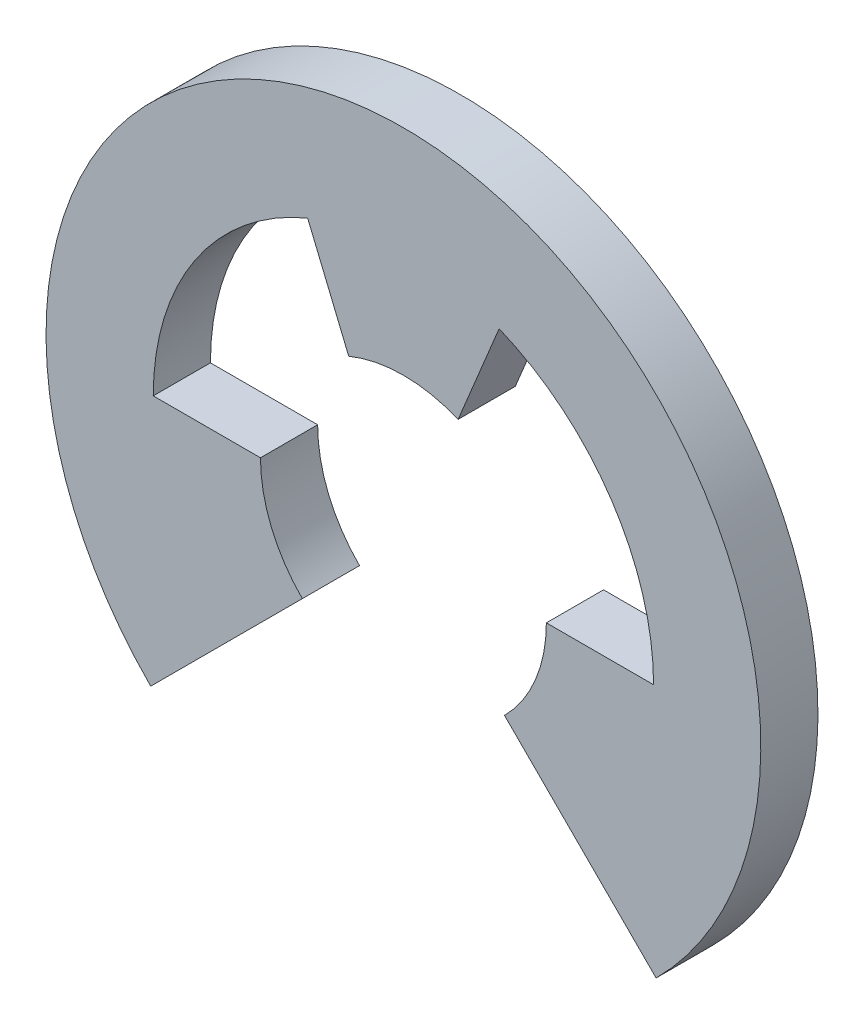
ISO-10303-21;
HEADER;
FILE_DESCRIPTION(('STEP AP214'),'2;1');
FILE_NAME('part.step','',(''),(''),'','','');
FILE_SCHEMA(('AUTOMOTIVE_DESIGN { 1 0 10303 214 1 1 1 1 }'));
ENDSEC;
DATA;
#1=APPLICATION_CONTEXT('core data for automotive mechanical design processes');
#2=APPLICATION_PROTOCOL_DEFINITION('international standard','automotive_design',2000,#1);
#3=PRODUCT_CONTEXT('',#1,'mechanical');
#4=PRODUCT('Part','Part','',(#3));
#5=PRODUCT_RELATED_PRODUCT_CATEGORY('part','',(#4));
#6=PRODUCT_DEFINITION_FORMATION('','',#4);
#7=PRODUCT_DEFINITION_CONTEXT('part definition',#1,'design');
#8=PRODUCT_DEFINITION('design','',#6,#7);
#9=PRODUCT_DEFINITION_SHAPE('','',#8);
#10=(LENGTH_UNIT() NAMED_UNIT(*) SI_UNIT(.MILLI.,.METRE.));
#11=(NAMED_UNIT(*) PLANE_ANGLE_UNIT() SI_UNIT($,.RADIAN.));
#12=(NAMED_UNIT(*) SI_UNIT($,.STERADIAN.) SOLID_ANGLE_UNIT());
#13=UNCERTAINTY_MEASURE_WITH_UNIT(LENGTH_MEASURE(1.E-05),#10,'distance_accuracy_value','');
#14=(GEOMETRIC_REPRESENTATION_CONTEXT(3) GLOBAL_UNCERTAINTY_ASSIGNED_CONTEXT((#13)) GLOBAL_UNIT_ASSIGNED_CONTEXT((#10,
#11,#12)) REPRESENTATION_CONTEXT('',''));
#15=CARTESIAN_POINT('',(0.,0.,0.));
#16=DIRECTION('',(0.,0.,1.));
#17=DIRECTION('',(1.,0.,0.));
#18=AXIS2_PLACEMENT_3D('',#15,#16,#17);
#19=CARTESIAN_POINT('',(0.,0.,-0.4));
#20=DIRECTION('',(0.,0.,1.));
#21=DIRECTION('',(1.,0.,0.));
#22=AXIS2_PLACEMENT_3D('',#19,#20,#21);
#23=CYLINDRICAL_SURFACE('',#22,1.);
#24=CARTESIAN_POINT('',(0.,0.,0.));
#25=DIRECTION('',(0.,0.,-1.));
#26=DIRECTION('',(1.,0.,0.));
#27=AXIS2_PLACEMENT_3D('',#24,#25,#26);
#28=CIRCLE('',#27,1.);
#29=CARTESIAN_POINT('',(1.,0.,0.));
#30=VERTEX_POINT('',#29);
#31=CARTESIAN_POINT('',(0.707106781186549,-0.707106781186546,0.));
#32=VERTEX_POINT('',#31);
#33=EDGE_CURVE('E153',#30,#32,#28,.T.);
#34=ORIENTED_EDGE('',*,*,#33,.F.);
#35=DIRECTION('',(0.,0.,1.));
#36=VECTOR('',#35,1.);
#37=CARTESIAN_POINT('',(1.,0.,-0.4));
#38=LINE('',#37,#36);
#39=CARTESIAN_POINT('',(1.,0.,-0.4));
#40=VERTEX_POINT('',#39);
#41=EDGE_CURVE('E11',#40,#30,#38,.T.);
#42=ORIENTED_EDGE('',*,*,#41,.F.);
#43=CARTESIAN_POINT('',(0.,0.,-0.4));
#44=DIRECTION('',(0.,0.,-1.));
#45=DIRECTION('',(1.,0.,0.));
#46=AXIS2_PLACEMENT_3D('',#43,#44,#45);
#47=CIRCLE('',#46,1.);
#48=CARTESIAN_POINT('',(0.707106781186549,-0.707106781186546,-0.4));
#49=VERTEX_POINT('',#48);
#50=EDGE_CURVE('E185',#40,#49,#47,.T.);
#51=ORIENTED_EDGE('',*,*,#50,.T.);
#52=DIRECTION('',(0.,0.,1.));
#53=VECTOR('',#52,1.);
#54=CARTESIAN_POINT('',(0.707106781186549,-0.707106781186546,-0.4));
#55=LINE('',#54,#53);
#56=EDGE_CURVE('E35',#49,#32,#55,.T.);
#57=ORIENTED_EDGE('',*,*,#56,.T.);
#58=EDGE_LOOP('',(#34,#42,#51,#57));
#59=FACE_BOUND('',#58,.T.);
#60=ADVANCED_FACE('F32',(#59),#23,.F.);
#61=CARTESIAN_POINT('',(1.,0.,-0.4));
#62=DIRECTION('',(0.,1.,0.));
#63=DIRECTION('',(-1.,0.,0.));
#64=AXIS2_PLACEMENT_3D('',#61,#62,#63);
#65=PLANE('',#64);
#66=DIRECTION('',(-1.,0.,0.));
#67=VECTOR('',#66,1.);
#68=CARTESIAN_POINT('',(1.,0.,0.));
#69=LINE('',#68,#67);
#70=CARTESIAN_POINT('',(1.75,0.,0.));
#71=VERTEX_POINT('',#70);
#72=EDGE_CURVE('E183',#71,#30,#69,.T.);
#73=ORIENTED_EDGE('',*,*,#72,.F.);
#74=DIRECTION('',(0.,0.,1.));
#75=VECTOR('',#74,1.);
#76=CARTESIAN_POINT('',(1.75,0.,-0.4));
#77=LINE('',#76,#75);
#78=CARTESIAN_POINT('',(1.75,0.,-0.4));
#79=VERTEX_POINT('',#78);
#80=EDGE_CURVE('E41',#79,#71,#77,.T.);
#81=ORIENTED_EDGE('',*,*,#80,.F.);
#82=DIRECTION('',(-1.,0.,0.));
#83=VECTOR('',#82,1.);
#84=CARTESIAN_POINT('',(1.,0.,-0.4));
#85=LINE('',#84,#83);
#86=EDGE_CURVE('E143',#79,#40,#85,.T.);
#87=ORIENTED_EDGE('',*,*,#86,.T.);
#88=ORIENTED_EDGE('',*,*,#41,.T.);
#89=EDGE_LOOP('',(#73,#81,#87,#88));
#90=FACE_BOUND('',#89,.T.);
#91=ADVANCED_FACE('F205',(#90),#65,.T.);
#92=CARTESIAN_POINT('',(0.,0.,-0.4));
#93=DIRECTION('',(0.,0.,1.));
#94=DIRECTION('',(1.,0.,0.));
#95=AXIS2_PLACEMENT_3D('',#92,#93,#94);
#96=CYLINDRICAL_SURFACE('',#95,1.75);
#97=CARTESIAN_POINT('',(0.,0.,0.));
#98=DIRECTION('',(0.,0.,-1.));
#99=DIRECTION('',(1.,0.,0.));
#100=AXIS2_PLACEMENT_3D('',#97,#98,#99);
#101=CIRCLE('',#100,1.75);
#102=CARTESIAN_POINT('',(0.669696006638908,1.61678918189475,0.));
#103=VERTEX_POINT('',#102);
#104=EDGE_CURVE('E130',#103,#71,#101,.T.);
#105=ORIENTED_EDGE('',*,*,#104,.F.);
#106=DIRECTION('',(0.,0.,1.));
#107=VECTOR('',#106,1.);
#108=CARTESIAN_POINT('',(0.669696006638908,1.61678918189475,-0.4));
#109=LINE('',#108,#107);
#110=CARTESIAN_POINT('',(0.669696006638908,1.61678918189475,-0.4));
#111=VERTEX_POINT('',#110);
#112=EDGE_CURVE('E125',#111,#103,#109,.T.);
#113=ORIENTED_EDGE('',*,*,#112,.F.);
#114=CARTESIAN_POINT('',(0.,0.,-0.4));
#115=DIRECTION('',(0.,0.,-1.));
#116=DIRECTION('',(1.,0.,0.));
#117=AXIS2_PLACEMENT_3D('',#114,#115,#116);
#118=CIRCLE('',#117,1.75);
#119=EDGE_CURVE('E128',#111,#79,#118,.T.);
#120=ORIENTED_EDGE('',*,*,#119,.T.);
#121=ORIENTED_EDGE('',*,*,#80,.T.);
#122=EDGE_LOOP('',(#105,#113,#120,#121));
#123=FACE_BOUND('',#122,.T.);
#124=ADVANCED_FACE('F127',(#123),#96,.F.);
#125=CARTESIAN_POINT('',(0.38268343236509,0.923879532511287,-0.4));
#126=DIRECTION('',(0.923879532511287,-0.38268343236509,0.));
#127=DIRECTION('',(0.38268343236509,0.923879532511287,0.));
#128=AXIS2_PLACEMENT_3D('',#125,#126,#127);
#129=PLANE('',#128);
#130=DIRECTION('',(0.38268343236509,0.923879532511287,0.));
#131=VECTOR('',#130,1.);
#132=CARTESIAN_POINT('',(0.38268343236509,0.923879532511287,0.));
#133=LINE('',#132,#131);
#134=CARTESIAN_POINT('',(0.38268343236509,0.923879532511287,0.));
#135=VERTEX_POINT('',#134);
#136=EDGE_CURVE('E180',#135,#103,#133,.T.);
#137=ORIENTED_EDGE('',*,*,#136,.F.);
#138=DIRECTION('',(0.,0.,1.));
#139=VECTOR('',#138,1.);
#140=CARTESIAN_POINT('',(0.38268343236509,0.923879532511287,-0.4));
#141=LINE('',#140,#139);
#142=CARTESIAN_POINT('',(0.38268343236509,0.923879532511287,-0.4));
#143=VERTEX_POINT('',#142);
#144=EDGE_CURVE('E135',#143,#135,#141,.T.);
#145=ORIENTED_EDGE('',*,*,#144,.F.);
#146=DIRECTION('',(0.38268343236509,0.923879532511287,0.));
#147=VECTOR('',#146,1.);
#148=CARTESIAN_POINT('',(0.38268343236509,0.923879532511287,-0.4));
#149=LINE('',#148,#147);
#150=EDGE_CURVE('E141',#143,#111,#149,.T.);
#151=ORIENTED_EDGE('',*,*,#150,.T.);
#152=ORIENTED_EDGE('',*,*,#112,.T.);
#153=EDGE_LOOP('',(#137,#145,#151,#152));
#154=FACE_BOUND('',#153,.T.);
#155=ADVANCED_FACE('F145',(#154),#129,.T.);
#156=CARTESIAN_POINT('',(0.,0.,-0.4));
#157=DIRECTION('',(0.,0.,1.));
#158=DIRECTION('',(1.,0.,0.));
#159=AXIS2_PLACEMENT_3D('',#156,#157,#158);
#160=CYLINDRICAL_SURFACE('',#159,1.);
#161=CARTESIAN_POINT('',(0.,0.,0.));
#162=DIRECTION('',(0.,0.,-1.));
#163=DIRECTION('',(1.,0.,0.));
#164=AXIS2_PLACEMENT_3D('',#161,#162,#163);
#165=CIRCLE('',#164,1.);
#166=CARTESIAN_POINT('',(-0.38268343236509,0.923879532511287,0.));
#167=VERTEX_POINT('',#166);
#168=EDGE_CURVE('E177',#167,#135,#165,.T.);
#169=ORIENTED_EDGE('',*,*,#168,.F.);
#170=DIRECTION('',(0.,0.,1.));
#171=VECTOR('',#170,1.);
#172=CARTESIAN_POINT('',(-0.38268343236509,0.923879532511287,-0.4));
#173=LINE('',#172,#171);
#174=CARTESIAN_POINT('',(-0.38268343236509,0.923879532511287,-0.4));
#175=VERTEX_POINT('',#174);
#176=EDGE_CURVE('E189',#175,#167,#173,.T.);
#177=ORIENTED_EDGE('',*,*,#176,.F.);
#178=CARTESIAN_POINT('',(0.,0.,-0.4));
#179=DIRECTION('',(0.,0.,-1.));
#180=DIRECTION('',(1.,0.,0.));
#181=AXIS2_PLACEMENT_3D('',#178,#179,#180);
#182=CIRCLE('',#181,1.);
#183=EDGE_CURVE('E146',#175,#143,#182,.T.);
#184=ORIENTED_EDGE('',*,*,#183,.T.);
#185=ORIENTED_EDGE('',*,*,#144,.T.);
#186=EDGE_LOOP('',(#169,#177,#184,#185));
#187=FACE_BOUND('',#186,.T.);
#188=ADVANCED_FACE('F218',(#187),#160,.F.);
#189=CARTESIAN_POINT('',(-0.38268343236509,0.923879532511287,-0.4));
#190=DIRECTION('',(-0.923879532511287,-0.38268343236509,0.));
#191=DIRECTION('',(0.38268343236509,-0.923879532511287,0.));
#192=AXIS2_PLACEMENT_3D('',#189,#190,#191);
#193=PLANE('',#192);
#194=DIRECTION('',(0.38268343236509,-0.923879532511287,0.));
#195=VECTOR('',#194,1.);
#196=CARTESIAN_POINT('',(-0.38268343236509,0.923879532511287,0.));
#197=LINE('',#196,#195);
#198=CARTESIAN_POINT('',(-0.669696006638908,1.61678918189475,0.));
#199=VERTEX_POINT('',#198);
#200=EDGE_CURVE('E174',#199,#167,#197,.T.);
#201=ORIENTED_EDGE('',*,*,#200,.F.);
#202=DIRECTION('',(0.,0.,1.));
#203=VECTOR('',#202,1.);
#204=CARTESIAN_POINT('',(-0.669696006638908,1.61678918189475,-0.4));
#205=LINE('',#204,#203);
#206=CARTESIAN_POINT('',(-0.669696006638908,1.61678918189475,-0.4));
#207=VERTEX_POINT('',#206);
#208=EDGE_CURVE('E191',#207,#199,#205,.T.);
#209=ORIENTED_EDGE('',*,*,#208,.F.);
#210=DIRECTION('',(0.38268343236509,-0.923879532511287,0.));
#211=VECTOR('',#210,1.);
#212=CARTESIAN_POINT('',(-0.38268343236509,0.923879532511287,-0.4));
#213=LINE('',#212,#211);
#214=EDGE_CURVE('E148',#207,#175,#213,.T.);
#215=ORIENTED_EDGE('',*,*,#214,.T.);
#216=ORIENTED_EDGE('',*,*,#176,.T.);
#217=EDGE_LOOP('',(#201,#209,#215,#216));
#218=FACE_BOUND('',#217,.T.);
#219=ADVANCED_FACE('F221',(#218),#193,.T.);
#220=CARTESIAN_POINT('',(0.,0.,-0.4));
#221=DIRECTION('',(0.,0.,1.));
#222=DIRECTION('',(1.,0.,0.));
#223=AXIS2_PLACEMENT_3D('',#220,#221,#222);
#224=CYLINDRICAL_SURFACE('',#223,1.75);
#225=CARTESIAN_POINT('',(0.,0.,0.));
#226=DIRECTION('',(0.,0.,-1.));
#227=DIRECTION('',(1.,0.,0.));
#228=AXIS2_PLACEMENT_3D('',#225,#226,#227);
#229=CIRCLE('',#228,1.75);
#230=CARTESIAN_POINT('',(-1.75,0.,0.));
#231=VERTEX_POINT('',#230);
#232=EDGE_CURVE('E171',#231,#199,#229,.T.);
#233=ORIENTED_EDGE('',*,*,#232,.F.);
#234=DIRECTION('',(0.,0.,1.));
#235=VECTOR('',#234,1.);
#236=CARTESIAN_POINT('',(-1.75,0.,-0.4));
#237=LINE('',#236,#235);
#238=CARTESIAN_POINT('',(-1.75,0.,-0.4));
#239=VERTEX_POINT('',#238);
#240=EDGE_CURVE('E193',#239,#231,#237,.T.);
#241=ORIENTED_EDGE('',*,*,#240,.F.);
#242=CARTESIAN_POINT('',(0.,0.,-0.4));
#243=DIRECTION('',(0.,0.,-1.));
#244=DIRECTION('',(1.,0.,0.));
#245=AXIS2_PLACEMENT_3D('',#242,#243,#244);
#246=CIRCLE('',#245,1.75);
#247=EDGE_CURVE('E375',#239,#207,#246,.T.);
#248=ORIENTED_EDGE('',*,*,#247,.T.);
#249=ORIENTED_EDGE('',*,*,#208,.T.);
#250=EDGE_LOOP('',(#233,#241,#248,#249));
#251=FACE_BOUND('',#250,.T.);
#252=ADVANCED_FACE('F225',(#251),#224,.F.);
#253=CARTESIAN_POINT('',(-1.,0.,-0.4));
#254=DIRECTION('',(0.,1.,0.));
#255=DIRECTION('',(-1.,0.,0.));
#256=AXIS2_PLACEMENT_3D('',#253,#254,#255);
#257=PLANE('',#256);
#258=DIRECTION('',(-1.,0.,0.));
#259=VECTOR('',#258,1.);
#260=CARTESIAN_POINT('',(-1.,0.,0.));
#261=LINE('',#260,#259);
#262=CARTESIAN_POINT('',(-1.,0.,0.));
#263=VERTEX_POINT('',#262);
#264=EDGE_CURVE('E168',#263,#231,#261,.T.);
#265=ORIENTED_EDGE('',*,*,#264,.F.);
#266=DIRECTION('',(0.,0.,1.));
#267=VECTOR('',#266,1.);
#268=CARTESIAN_POINT('',(-1.,0.,-0.4));
#269=LINE('',#268,#267);
#270=CARTESIAN_POINT('',(-1.,0.,-0.4));
#271=VERTEX_POINT('',#270);
#272=EDGE_CURVE('E195',#271,#263,#269,.T.);
#273=ORIENTED_EDGE('',*,*,#272,.F.);
#274=DIRECTION('',(-1.,0.,0.));
#275=VECTOR('',#274,1.);
#276=CARTESIAN_POINT('',(-1.,0.,-0.4));
#277=LINE('',#276,#275);
#278=EDGE_CURVE('E379',#271,#239,#277,.T.);
#279=ORIENTED_EDGE('',*,*,#278,.T.);
#280=ORIENTED_EDGE('',*,*,#240,.T.);
#281=EDGE_LOOP('',(#265,#273,#279,#280));
#282=FACE_BOUND('',#281,.T.);
#283=ADVANCED_FACE('F229',(#282),#257,.T.);
#284=CARTESIAN_POINT('',(0.,0.,-0.4));
#285=DIRECTION('',(0.,0.,1.));
#286=DIRECTION('',(1.,0.,0.));
#287=AXIS2_PLACEMENT_3D('',#284,#285,#286);
#288=CYLINDRICAL_SURFACE('',#287,1.);
#289=CARTESIAN_POINT('',(0.,0.,0.));
#290=DIRECTION('',(0.,0.,-1.));
#291=DIRECTION('',(1.,0.,0.));
#292=AXIS2_PLACEMENT_3D('',#289,#290,#291);
#293=CIRCLE('',#292,1.);
#294=CARTESIAN_POINT('',(-0.707106781186549,-0.707106781186546,0.));
#295=VERTEX_POINT('',#294);
#296=EDGE_CURVE('E165',#295,#263,#293,.T.);
#297=ORIENTED_EDGE('',*,*,#296,.F.);
#298=DIRECTION('',(0.,0.,1.));
#299=VECTOR('',#298,1.);
#300=CARTESIAN_POINT('',(-0.707106781186549,-0.707106781186546,-0.4));
#301=LINE('',#300,#299);
#302=CARTESIAN_POINT('',(-0.707106781186549,-0.707106781186546,-0.4));
#303=VERTEX_POINT('',#302);
#304=EDGE_CURVE('E197',#303,#295,#301,.T.);
#305=ORIENTED_EDGE('',*,*,#304,.F.);
#306=CARTESIAN_POINT('',(0.,0.,-0.4));
#307=DIRECTION('',(0.,0.,-1.));
#308=DIRECTION('',(1.,0.,0.));
#309=AXIS2_PLACEMENT_3D('',#306,#307,#308);
#310=CIRCLE('',#309,1.);
#311=EDGE_CURVE('E368',#303,#271,#310,.T.);
#312=ORIENTED_EDGE('',*,*,#311,.T.);
#313=ORIENTED_EDGE('',*,*,#272,.T.);
#314=EDGE_LOOP('',(#297,#305,#312,#313));
#315=FACE_BOUND('',#314,.T.);
#316=ADVANCED_FACE('F233',(#315),#288,.F.);
#317=CARTESIAN_POINT('',(-0.707106781186549,-0.707106781186546,-0.4));
#318=DIRECTION('',(0.707106781186546,-0.707106781186549,0.));
#319=DIRECTION('',(0.707106781186549,0.707106781186546,0.));
#320=AXIS2_PLACEMENT_3D('',#317,#318,#319);
#321=PLANE('',#320);
#322=DIRECTION('',(0.707106781186549,0.707106781186546,0.));
#323=VECTOR('',#322,1.);
#324=CARTESIAN_POINT('',(-0.707106781186549,-0.707106781186546,0.));
#325=LINE('',#324,#323);
#326=CARTESIAN_POINT('',(-1.76776695296637,-1.76776695296637,0.));
#327=VERTEX_POINT('',#326);
#328=EDGE_CURVE('E162',#327,#295,#325,.T.);
#329=ORIENTED_EDGE('',*,*,#328,.F.);
#330=DIRECTION('',(0.,0.,1.));
#331=VECTOR('',#330,1.);
#332=CARTESIAN_POINT('',(-1.76776695296637,-1.76776695296637,-0.4));
#333=LINE('',#332,#331);
#334=CARTESIAN_POINT('',(-1.76776695296637,-1.76776695296637,-0.4));
#335=VERTEX_POINT('',#334);
#336=EDGE_CURVE('E199',#335,#327,#333,.T.);
#337=ORIENTED_EDGE('',*,*,#336,.F.);
#338=DIRECTION('',(0.707106781186549,0.707106781186546,0.));
#339=VECTOR('',#338,1.);
#340=CARTESIAN_POINT('',(-0.707106781186549,-0.707106781186546,-0.4));
#341=LINE('',#340,#339);
#342=EDGE_CURVE('E364',#335,#303,#341,.T.);
#343=ORIENTED_EDGE('',*,*,#342,.T.);
#344=ORIENTED_EDGE('',*,*,#304,.T.);
#345=EDGE_LOOP('',(#329,#337,#343,#344));
#346=FACE_BOUND('',#345,.T.);
#347=ADVANCED_FACE('F237',(#346),#321,.T.);
#348=CARTESIAN_POINT('',(0.,0.,-0.4));
#349=DIRECTION('',(0.,0.,1.));
#350=DIRECTION('',(1.,0.,0.));
#351=AXIS2_PLACEMENT_3D('',#348,#349,#350);
#352=CYLINDRICAL_SURFACE('',#351,2.5);
#353=CARTESIAN_POINT('',(0.,0.,0.));
#354=DIRECTION('',(0.,0.,1.));
#355=DIRECTION('',(1.,0.,0.));
#356=AXIS2_PLACEMENT_3D('',#353,#354,#355);
#357=CIRCLE('',#356,2.5);
#358=CARTESIAN_POINT('',(1.76776695296637,-1.76776695296637,0.));
#359=VERTEX_POINT('',#358);
#360=EDGE_CURVE('E159',#359,#327,#357,.T.);
#361=ORIENTED_EDGE('',*,*,#360,.F.);
#362=DIRECTION('',(0.,0.,1.));
#363=VECTOR('',#362,1.);
#364=CARTESIAN_POINT('',(1.76776695296637,-1.76776695296637,-0.4));
#365=LINE('',#364,#363);
#366=CARTESIAN_POINT('',(1.76776695296637,-1.76776695296637,-0.4));
#367=VERTEX_POINT('',#366);
#368=EDGE_CURVE('E200',#367,#359,#365,.T.);
#369=ORIENTED_EDGE('',*,*,#368,.F.);
#370=CARTESIAN_POINT('',(0.,0.,-0.4));
#371=DIRECTION('',(0.,0.,1.));
#372=DIRECTION('',(1.,0.,0.));
#373=AXIS2_PLACEMENT_3D('',#370,#371,#372);
#374=CIRCLE('',#373,2.5);
#375=EDGE_CURVE('E385',#367,#335,#374,.T.);
#376=ORIENTED_EDGE('',*,*,#375,.T.);
#377=ORIENTED_EDGE('',*,*,#336,.T.);
#378=EDGE_LOOP('',(#361,#369,#376,#377));
#379=FACE_BOUND('',#378,.T.);
#380=ADVANCED_FACE('F241',(#379),#352,.T.);
#381=CARTESIAN_POINT('',(0.707106781186549,-0.707106781186546,-0.4));
#382=DIRECTION('',(-0.707106781186546,-0.707106781186549,0.));
#383=DIRECTION('',(0.707106781186549,-0.707106781186546,0.));
#384=AXIS2_PLACEMENT_3D('',#381,#382,#383);
#385=PLANE('',#384);
#386=DIRECTION('',(0.707106781186549,-0.707106781186546,0.));
#387=VECTOR('',#386,1.);
#388=CARTESIAN_POINT('',(0.707106781186549,-0.707106781186546,0.));
#389=LINE('',#388,#387);
#390=EDGE_CURVE('E156',#32,#359,#389,.T.);
#391=ORIENTED_EDGE('',*,*,#390,.F.);
#392=ORIENTED_EDGE('',*,*,#56,.F.);
#393=DIRECTION('',(0.707106781186549,-0.707106781186546,0.));
#394=VECTOR('',#393,1.);
#395=CARTESIAN_POINT('',(0.707106781186549,-0.707106781186546,-0.4));
#396=LINE('',#395,#394);
#397=EDGE_CURVE('E387',#49,#367,#396,.T.);
#398=ORIENTED_EDGE('',*,*,#397,.T.);
#399=ORIENTED_EDGE('',*,*,#368,.T.);
#400=EDGE_LOOP('',(#391,#392,#398,#399));
#401=FACE_BOUND('',#400,.T.);
#402=ADVANCED_FACE('F202',(#401),#385,.T.);
#403=CARTESIAN_POINT('',(0.,0.,-0.4));
#404=DIRECTION('',(0.,0.,1.));
#405=DIRECTION('',(1.,0.,0.));
#406=AXIS2_PLACEMENT_3D('',#403,#404,#405);
#407=PLANE('',#406);
#408=ORIENTED_EDGE('',*,*,#50,.F.);
#409=ORIENTED_EDGE('',*,*,#86,.F.);
#410=ORIENTED_EDGE('',*,*,#119,.F.);
#411=ORIENTED_EDGE('',*,*,#150,.F.);
#412=ORIENTED_EDGE('',*,*,#183,.F.);
#413=ORIENTED_EDGE('',*,*,#214,.F.);
#414=ORIENTED_EDGE('',*,*,#247,.F.);
#415=ORIENTED_EDGE('',*,*,#278,.F.);
#416=ORIENTED_EDGE('',*,*,#311,.F.);
#417=ORIENTED_EDGE('',*,*,#342,.F.);
#418=ORIENTED_EDGE('',*,*,#375,.F.);
#419=ORIENTED_EDGE('',*,*,#397,.F.);
#420=EDGE_LOOP('',(#408,#409,#410,#411,#412,#413,#414,#415,#416,#417,#418,#419));
#421=FACE_BOUND('',#420,.T.);
#422=ADVANCED_FACE('F139',(#421),#407,.F.);
#423=CARTESIAN_POINT('',(0.,0.,0.));
#424=DIRECTION('',(0.,0.,1.));
#425=DIRECTION('',(1.,0.,0.));
#426=AXIS2_PLACEMENT_3D('',#423,#424,#425);
#427=PLANE('',#426);
#428=ORIENTED_EDGE('',*,*,#33,.T.);
#429=ORIENTED_EDGE('',*,*,#390,.T.);
#430=ORIENTED_EDGE('',*,*,#360,.T.);
#431=ORIENTED_EDGE('',*,*,#328,.T.);
#432=ORIENTED_EDGE('',*,*,#296,.T.);
#433=ORIENTED_EDGE('',*,*,#264,.T.);
#434=ORIENTED_EDGE('',*,*,#232,.T.);
#435=ORIENTED_EDGE('',*,*,#200,.T.);
#436=ORIENTED_EDGE('',*,*,#168,.T.);
#437=ORIENTED_EDGE('',*,*,#136,.T.);
#438=ORIENTED_EDGE('',*,*,#104,.T.);
#439=ORIENTED_EDGE('',*,*,#72,.T.);
#440=EDGE_LOOP('',(#428,#429,#430,#431,#432,#433,#434,#435,#436,#437,#438,#439));
#441=FACE_BOUND('',#440,.T.);
#442=ADVANCED_FACE('F204',(#441),#427,.T.);
#443=CLOSED_SHELL('',(#60,#91,#124,#155,#188,#219,#252,#283,#316,#347,#380,#402,#422,#442));
#444=MANIFOLD_SOLID_BREP('B2',#443);
#445=ADVANCED_BREP_SHAPE_REPRESENTATION('',(#18,#444),#14);
#446=SHAPE_DEFINITION_REPRESENTATION(#9,#445);
ENDSEC;
END-ISO-10303-21;
